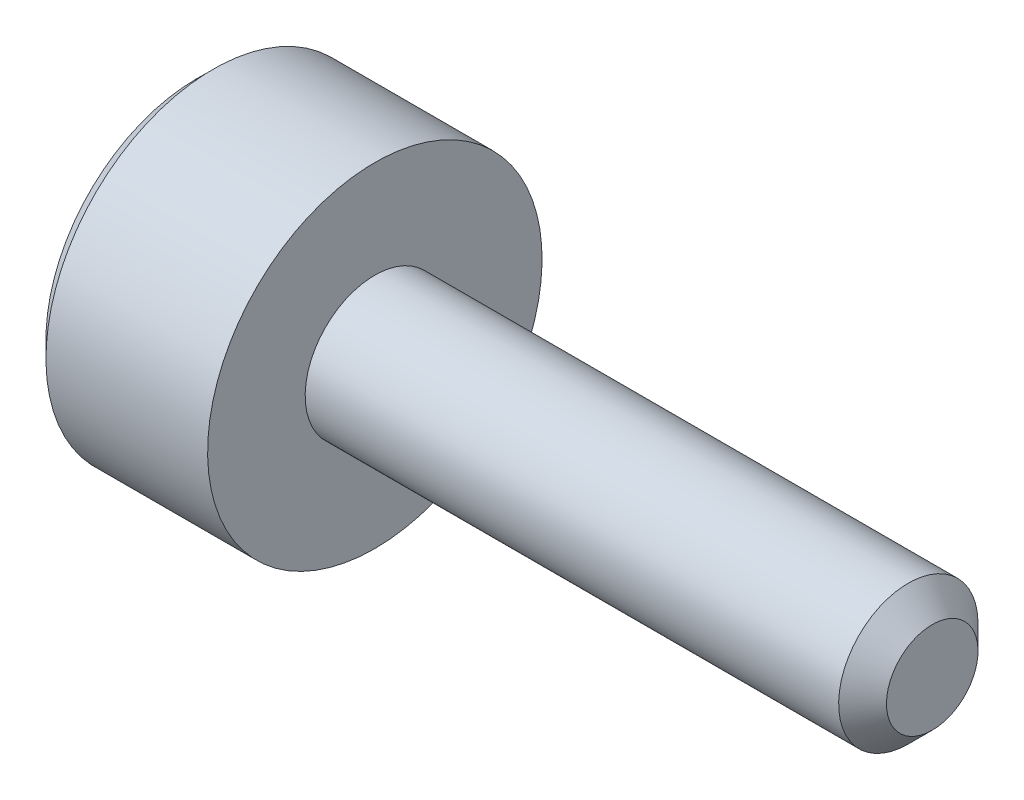
ISO-10303-21;
HEADER;
FILE_DESCRIPTION(('STEP AP214'),'2;1');
FILE_NAME('part.step','',(''),(''),'','','');
FILE_SCHEMA(('AUTOMOTIVE_DESIGN { 1 0 10303 214 1 1 1 1 }'));
ENDSEC;
DATA;
#1=APPLICATION_CONTEXT('core data for automotive mechanical design processes');
#2=APPLICATION_PROTOCOL_DEFINITION('international standard','automotive_design',2000,#1);
#3=PRODUCT_CONTEXT('',#1,'mechanical');
#4=PRODUCT('Part','Part','',(#3));
#5=PRODUCT_RELATED_PRODUCT_CATEGORY('part','',(#4));
#6=PRODUCT_DEFINITION_FORMATION('','',#4);
#7=PRODUCT_DEFINITION_CONTEXT('part definition',#1,'design');
#8=PRODUCT_DEFINITION('design','',#6,#7);
#9=PRODUCT_DEFINITION_SHAPE('','',#8);
#10=(LENGTH_UNIT() NAMED_UNIT(*) SI_UNIT(.MILLI.,.METRE.));
#11=(NAMED_UNIT(*) PLANE_ANGLE_UNIT() SI_UNIT($,.RADIAN.));
#12=(NAMED_UNIT(*) SI_UNIT($,.STERADIAN.) SOLID_ANGLE_UNIT());
#13=UNCERTAINTY_MEASURE_WITH_UNIT(LENGTH_MEASURE(1.E-05),#10,'distance_accuracy_value','');
#14=(GEOMETRIC_REPRESENTATION_CONTEXT(3) GLOBAL_UNCERTAINTY_ASSIGNED_CONTEXT((#13)) GLOBAL_UNIT_ASSIGNED_CONTEXT((#10,
#11,#12)) REPRESENTATION_CONTEXT('',''));
#15=CARTESIAN_POINT('',(0.,0.,0.));
#16=DIRECTION('',(0.,0.,1.));
#17=DIRECTION('',(1.,0.,0.));
#18=AXIS2_PLACEMENT_3D('',#15,#16,#17);
#19=CARTESIAN_POINT('',(-1.6,0.,0.));
#20=DIRECTION('',(1.,0.,0.));
#21=DIRECTION('',(0.,1.,0.));
#22=AXIS2_PLACEMENT_3D('',#19,#20,#21);
#23=PLANE('',#22);
#24=CARTESIAN_POINT('',(-1.6,0.,0.));
#25=DIRECTION('',(-1.,0.,0.));
#26=DIRECTION('',(0.,-1.,0.));
#27=AXIS2_PLACEMENT_3D('',#24,#25,#26);
#28=CIRCLE('',#27,1.35);
#29=CARTESIAN_POINT('',(-1.6,-1.35,0.));
#30=VERTEX_POINT('',#29);
#31=EDGE_CURVE('E11',#30,#30,#28,.T.);
#32=ORIENTED_EDGE('',*,*,#31,.T.);
#33=EDGE_LOOP('',(#32));
#34=FACE_BOUND('',#33,.T.);
#35=DIRECTION('',(0.,-1.,0.));
#36=VECTOR('',#35,1.);
#37=CARTESIAN_POINT('',(-1.6,0.43301270189222,0.75));
#38=LINE('',#37,#36);
#39=CARTESIAN_POINT('',(-1.6,0.43301270189222,0.75));
#40=VERTEX_POINT('',#39);
#41=CARTESIAN_POINT('',(-1.6,-0.43301270189222,0.75));
#42=VERTEX_POINT('',#41);
#43=EDGE_CURVE('E51',#40,#42,#38,.T.);
#44=ORIENTED_EDGE('',*,*,#43,.T.);
#45=DIRECTION('',(0.,-0.500000000000001,-0.866025403784438));
#46=VECTOR('',#45,1.);
#47=CARTESIAN_POINT('',(-1.6,-0.43301270189222,0.75));
#48=LINE('',#47,#46);
#49=CARTESIAN_POINT('',(-1.6,-0.86602540378444,0.));
#50=VERTEX_POINT('',#49);
#51=EDGE_CURVE('E122',#42,#50,#48,.T.);
#52=ORIENTED_EDGE('',*,*,#51,.T.);
#53=DIRECTION('',(0.,0.500000000000001,-0.866025403784438));
#54=VECTOR('',#53,1.);
#55=CARTESIAN_POINT('',(-1.6,-0.86602540378444,0.));
#56=LINE('',#55,#54);
#57=CARTESIAN_POINT('',(-1.6,-0.43301270189222,-0.75));
#58=VERTEX_POINT('',#57);
#59=EDGE_CURVE('E125',#50,#58,#56,.T.);
#60=ORIENTED_EDGE('',*,*,#59,.T.);
#61=DIRECTION('',(0.,1.,0.));
#62=VECTOR('',#61,1.);
#63=CARTESIAN_POINT('',(-1.6,-0.43301270189222,-0.75));
#64=LINE('',#63,#62);
#65=CARTESIAN_POINT('',(-1.6,0.43301270189222,-0.75));
#66=VERTEX_POINT('',#65);
#67=EDGE_CURVE('E128',#58,#66,#64,.T.);
#68=ORIENTED_EDGE('',*,*,#67,.T.);
#69=DIRECTION('',(0.,0.500000000000001,0.866025403784438));
#70=VECTOR('',#69,1.);
#71=CARTESIAN_POINT('',(-1.6,0.43301270189222,-0.75));
#72=LINE('',#71,#70);
#73=CARTESIAN_POINT('',(-1.6,0.86602540378444,0.));
#74=VERTEX_POINT('',#73);
#75=EDGE_CURVE('E112',#66,#74,#72,.T.);
#76=ORIENTED_EDGE('',*,*,#75,.T.);
#77=DIRECTION('',(0.,-0.500000000000001,0.866025403784438));
#78=VECTOR('',#77,1.);
#79=CARTESIAN_POINT('',(-1.6,0.86602540378444,0.));
#80=LINE('',#79,#78);
#81=EDGE_CURVE('E131',#74,#40,#80,.T.);
#82=ORIENTED_EDGE('',*,*,#81,.T.);
#83=EDGE_LOOP('',(#44,#52,#60,#68,#76,#82));
#84=FACE_BOUND('',#83,.T.);
#85=ADVANCED_FACE('F37',(#34,#84),#23,.F.);
#86=CARTESIAN_POINT('',(-1.45,0.,0.));
#87=DIRECTION('',(1.,0.,0.));
#88=DIRECTION('',(0.,1.,0.));
#89=AXIS2_PLACEMENT_3D('',#86,#87,#88);
#90=CONICAL_SURFACE('',#89,1.5,0.785398163397448);
#91=ORIENTED_EDGE('',*,*,#31,.F.);
#92=EDGE_LOOP('',(#91));
#93=FACE_BOUND('',#92,.T.);
#94=CARTESIAN_POINT('',(-1.45,0.,0.));
#95=DIRECTION('',(-1.,0.,0.));
#96=DIRECTION('',(0.,-1.,0.));
#97=AXIS2_PLACEMENT_3D('',#94,#95,#96);
#98=CIRCLE('',#97,1.5);
#99=CARTESIAN_POINT('',(-1.45,-1.5,0.));
#100=VERTEX_POINT('',#99);
#101=EDGE_CURVE('E44',#100,#100,#98,.T.);
#102=ORIENTED_EDGE('',*,*,#101,.T.);
#103=EDGE_LOOP('',(#102));
#104=FACE_BOUND('',#103,.T.);
#105=ADVANCED_FACE('F156',(#93,#104),#90,.T.);
#106=CARTESIAN_POINT('',(5.,0.,0.));
#107=DIRECTION('',(-1.,0.,0.));
#108=DIRECTION('',(0.,-1.,0.));
#109=AXIS2_PLACEMENT_3D('',#106,#107,#108);
#110=CYLINDRICAL_SURFACE('',#109,1.5);
#111=ORIENTED_EDGE('',*,*,#101,.F.);
#112=EDGE_LOOP('',(#111));
#113=FACE_BOUND('',#112,.T.);
#114=CARTESIAN_POINT('',(0.,0.,0.));
#115=DIRECTION('',(-1.,0.,0.));
#116=DIRECTION('',(0.,-1.,0.));
#117=AXIS2_PLACEMENT_3D('',#114,#115,#116);
#118=CIRCLE('',#117,1.5);
#119=CARTESIAN_POINT('',(0.,-1.5,0.));
#120=VERTEX_POINT('',#119);
#121=EDGE_CURVE('E151',#120,#120,#118,.T.);
#122=ORIENTED_EDGE('',*,*,#121,.T.);
#123=EDGE_LOOP('',(#122));
#124=FACE_BOUND('',#123,.T.);
#125=ADVANCED_FACE('F158',(#113,#124),#110,.T.);
#126=CARTESIAN_POINT('',(0.,1.5,0.));
#127=DIRECTION('',(-1.,0.,0.));
#128=DIRECTION('',(0.,-1.,0.));
#129=AXIS2_PLACEMENT_3D('',#126,#127,#128);
#130=PLANE('',#129);
#131=ORIENTED_EDGE('',*,*,#121,.F.);
#132=EDGE_LOOP('',(#131));
#133=FACE_BOUND('',#132,.T.);
#134=CARTESIAN_POINT('',(0.,0.,0.));
#135=DIRECTION('',(-1.,0.,0.));
#136=DIRECTION('',(0.,-1.,0.));
#137=AXIS2_PLACEMENT_3D('',#134,#135,#136);
#138=CIRCLE('',#137,0.625);
#139=CARTESIAN_POINT('',(0.,-0.625,0.));
#140=VERTEX_POINT('',#139);
#141=EDGE_CURVE('E148',#140,#140,#138,.T.);
#142=ORIENTED_EDGE('',*,*,#141,.T.);
#143=EDGE_LOOP('',(#142));
#144=FACE_BOUND('',#143,.T.);
#145=ADVANCED_FACE('F161',(#133,#144),#130,.F.);
#146=CARTESIAN_POINT('',(5.,0.,0.));
#147=DIRECTION('',(-1.,0.,0.));
#148=DIRECTION('',(0.,-1.,0.));
#149=AXIS2_PLACEMENT_3D('',#146,#147,#148);
#150=CYLINDRICAL_SURFACE('',#149,0.625);
#151=ORIENTED_EDGE('',*,*,#141,.F.);
#152=EDGE_LOOP('',(#151));
#153=FACE_BOUND('',#152,.T.);
#154=CARTESIAN_POINT('',(4.7855,0.,0.));
#155=DIRECTION('',(-1.,0.,0.));
#156=DIRECTION('',(0.,-1.,0.));
#157=AXIS2_PLACEMENT_3D('',#154,#155,#156);
#158=CIRCLE('',#157,0.625);
#159=CARTESIAN_POINT('',(4.7855,-0.624999999999999,0.));
#160=VERTEX_POINT('',#159);
#161=EDGE_CURVE('E145',#160,#160,#158,.T.);
#162=ORIENTED_EDGE('',*,*,#161,.T.);
#163=EDGE_LOOP('',(#162));
#164=FACE_BOUND('',#163,.T.);
#165=ADVANCED_FACE('F167',(#153,#164),#150,.T.);
#166=CARTESIAN_POINT('',(5.,0.,0.));
#167=DIRECTION('',(-1.,0.,0.));
#168=DIRECTION('',(0.,-1.,0.));
#169=AXIS2_PLACEMENT_3D('',#166,#167,#168);
#170=CONICAL_SURFACE('',#169,0.4105,0.785398163397447);
#171=ORIENTED_EDGE('',*,*,#161,.F.);
#172=EDGE_LOOP('',(#171));
#173=FACE_BOUND('',#172,.T.);
#174=CARTESIAN_POINT('',(5.,0.,0.));
#175=DIRECTION('',(-1.,0.,0.));
#176=DIRECTION('',(0.,-1.,0.));
#177=AXIS2_PLACEMENT_3D('',#174,#175,#176);
#178=CIRCLE('',#177,0.4105);
#179=CARTESIAN_POINT('',(5.,-0.410499999999999,0.));
#180=VERTEX_POINT('',#179);
#181=EDGE_CURVE('E142',#180,#180,#178,.T.);
#182=ORIENTED_EDGE('',*,*,#181,.T.);
#183=EDGE_LOOP('',(#182));
#184=FACE_BOUND('',#183,.T.);
#185=ADVANCED_FACE('F173',(#173,#184),#170,.T.);
#186=CARTESIAN_POINT('',(5.,0.410500000000001,0.));
#187=DIRECTION('',(-1.,0.,0.));
#188=DIRECTION('',(0.,-1.,0.));
#189=AXIS2_PLACEMENT_3D('',#186,#187,#188);
#190=PLANE('',#189);
#191=ORIENTED_EDGE('',*,*,#181,.F.);
#192=EDGE_LOOP('',(#191));
#193=FACE_BOUND('',#192,.T.);
#194=ADVANCED_FACE('F179',(#193),#190,.F.);
#195=CARTESIAN_POINT('',(-0.96,0.43301270189222,0.75));
#196=DIRECTION('',(0.,0.,-1.));
#197=DIRECTION('',(-1.,0.,0.));
#198=AXIS2_PLACEMENT_3D('',#195,#196,#197);
#199=PLANE('',#198);
#200=ORIENTED_EDGE('',*,*,#43,.F.);
#201=DIRECTION('',(-1.,0.,0.));
#202=VECTOR('',#201,1.);
#203=CARTESIAN_POINT('',(-0.96,0.43301270189222,0.75));
#204=LINE('',#203,#202);
#205=CARTESIAN_POINT('',(-0.96,0.43301270189222,0.75));
#206=VERTEX_POINT('',#205);
#207=EDGE_CURVE('E117',#206,#40,#204,.T.);
#208=ORIENTED_EDGE('',*,*,#207,.F.);
#209=DIRECTION('',(0.,-1.,0.));
#210=VECTOR('',#209,1.);
#211=CARTESIAN_POINT('',(-0.96,0.43301270189222,0.75));
#212=LINE('',#211,#210);
#213=CARTESIAN_POINT('',(-0.96,-0.43301270189222,0.75));
#214=VERTEX_POINT('',#213);
#215=EDGE_CURVE('E134',#206,#214,#212,.T.);
#216=ORIENTED_EDGE('',*,*,#215,.T.);
#217=DIRECTION('',(-1.,0.,0.));
#218=VECTOR('',#217,1.);
#219=CARTESIAN_POINT('',(-0.96,-0.43301270189222,0.75));
#220=LINE('',#219,#218);
#221=EDGE_CURVE('E140',#214,#42,#220,.T.);
#222=ORIENTED_EDGE('',*,*,#221,.T.);
#223=EDGE_LOOP('',(#200,#208,#216,#222));
#224=FACE_BOUND('',#223,.T.);
#225=ADVANCED_FACE('F184',(#224),#199,.T.);
#226=CARTESIAN_POINT('',(-0.96,-0.43301270189222,0.75));
#227=DIRECTION('',(0.,0.866025403784438,-0.500000000000001));
#228=DIRECTION('',(0.,0.500000000000001,0.866025403784438));
#229=AXIS2_PLACEMENT_3D('',#226,#227,#228);
#230=PLANE('',#229);
#231=ORIENTED_EDGE('',*,*,#51,.F.);
#232=ORIENTED_EDGE('',*,*,#221,.F.);
#233=DIRECTION('',(0.,-0.500000000000001,-0.866025403784438));
#234=VECTOR('',#233,1.);
#235=CARTESIAN_POINT('',(-0.96,-0.43301270189222,0.75));
#236=LINE('',#235,#234);
#237=CARTESIAN_POINT('',(-0.96,-0.86602540378444,0.));
#238=VERTEX_POINT('',#237);
#239=EDGE_CURVE('E90',#214,#238,#236,.T.);
#240=ORIENTED_EDGE('',*,*,#239,.T.);
#241=DIRECTION('',(-1.,0.,0.));
#242=VECTOR('',#241,1.);
#243=CARTESIAN_POINT('',(-0.96,-0.86602540378444,0.));
#244=LINE('',#243,#242);
#245=EDGE_CURVE('E138',#238,#50,#244,.T.);
#246=ORIENTED_EDGE('',*,*,#245,.T.);
#247=EDGE_LOOP('',(#231,#232,#240,#246));
#248=FACE_BOUND('',#247,.T.);
#249=ADVANCED_FACE('F189',(#248),#230,.T.);
#250=CARTESIAN_POINT('',(-0.96,-0.86602540378444,0.));
#251=DIRECTION('',(0.,0.866025403784438,0.500000000000001));
#252=DIRECTION('',(0.,-0.500000000000001,0.866025403784438));
#253=AXIS2_PLACEMENT_3D('',#250,#251,#252);
#254=PLANE('',#253);
#255=ORIENTED_EDGE('',*,*,#59,.F.);
#256=ORIENTED_EDGE('',*,*,#245,.F.);
#257=DIRECTION('',(0.,0.500000000000001,-0.866025403784438));
#258=VECTOR('',#257,1.);
#259=CARTESIAN_POINT('',(-0.96,-0.86602540378444,0.));
#260=LINE('',#259,#258);
#261=CARTESIAN_POINT('',(-0.96,-0.43301270189222,-0.75));
#262=VERTEX_POINT('',#261);
#263=EDGE_CURVE('E108',#238,#262,#260,.T.);
#264=ORIENTED_EDGE('',*,*,#263,.T.);
#265=DIRECTION('',(-1.,0.,0.));
#266=VECTOR('',#265,1.);
#267=CARTESIAN_POINT('',(-0.96,-0.43301270189222,-0.75));
#268=LINE('',#267,#266);
#269=EDGE_CURVE('E105',#262,#58,#268,.T.);
#270=ORIENTED_EDGE('',*,*,#269,.T.);
#271=EDGE_LOOP('',(#255,#256,#264,#270));
#272=FACE_BOUND('',#271,.T.);
#273=ADVANCED_FACE('F206',(#272),#254,.T.);
#274=CARTESIAN_POINT('',(-0.96,-0.43301270189222,-0.75));
#275=DIRECTION('',(0.,0.,1.));
#276=DIRECTION('',(1.,0.,0.));
#277=AXIS2_PLACEMENT_3D('',#274,#275,#276);
#278=PLANE('',#277);
#279=ORIENTED_EDGE('',*,*,#67,.F.);
#280=ORIENTED_EDGE('',*,*,#269,.F.);
#281=DIRECTION('',(0.,1.,0.));
#282=VECTOR('',#281,1.);
#283=CARTESIAN_POINT('',(-0.96,-0.43301270189222,-0.75));
#284=LINE('',#283,#282);
#285=CARTESIAN_POINT('',(-0.96,0.43301270189222,-0.75));
#286=VERTEX_POINT('',#285);
#287=EDGE_CURVE('E100',#262,#286,#284,.T.);
#288=ORIENTED_EDGE('',*,*,#287,.T.);
#289=DIRECTION('',(-1.,0.,0.));
#290=VECTOR('',#289,1.);
#291=CARTESIAN_POINT('',(-0.96,0.43301270189222,-0.75));
#292=LINE('',#291,#290);
#293=EDGE_CURVE('E104',#286,#66,#292,.T.);
#294=ORIENTED_EDGE('',*,*,#293,.T.);
#295=EDGE_LOOP('',(#279,#280,#288,#294));
#296=FACE_BOUND('',#295,.T.);
#297=ADVANCED_FACE('F103',(#296),#278,.T.);
#298=CARTESIAN_POINT('',(-0.96,0.43301270189222,-0.75));
#299=DIRECTION('',(0.,-0.866025403784438,0.500000000000001));
#300=DIRECTION('',(0.,-0.500000000000001,-0.866025403784438));
#301=AXIS2_PLACEMENT_3D('',#298,#299,#300);
#302=PLANE('',#301);
#303=ORIENTED_EDGE('',*,*,#75,.F.);
#304=ORIENTED_EDGE('',*,*,#293,.F.);
#305=DIRECTION('',(0.,0.500000000000001,0.866025403784438));
#306=VECTOR('',#305,1.);
#307=CARTESIAN_POINT('',(-0.96,0.43301270189222,-0.75));
#308=LINE('',#307,#306);
#309=CARTESIAN_POINT('',(-0.96,0.86602540378444,0.));
#310=VERTEX_POINT('',#309);
#311=EDGE_CURVE('E107',#286,#310,#308,.T.);
#312=ORIENTED_EDGE('',*,*,#311,.T.);
#313=DIRECTION('',(-1.,0.,0.));
#314=VECTOR('',#313,1.);
#315=CARTESIAN_POINT('',(-0.96,0.86602540378444,0.));
#316=LINE('',#315,#314);
#317=EDGE_CURVE('E81',#310,#74,#316,.T.);
#318=ORIENTED_EDGE('',*,*,#317,.T.);
#319=EDGE_LOOP('',(#303,#304,#312,#318));
#320=FACE_BOUND('',#319,.T.);
#321=ADVANCED_FACE('F110',(#320),#302,.T.);
#322=CARTESIAN_POINT('',(-0.96,0.86602540378444,0.));
#323=DIRECTION('',(0.,-0.866025403784438,-0.500000000000001));
#324=DIRECTION('',(0.,0.500000000000001,-0.866025403784438));
#325=AXIS2_PLACEMENT_3D('',#322,#323,#324);
#326=PLANE('',#325);
#327=ORIENTED_EDGE('',*,*,#81,.F.);
#328=ORIENTED_EDGE('',*,*,#317,.F.);
#329=DIRECTION('',(0.,-0.500000000000001,0.866025403784438));
#330=VECTOR('',#329,1.);
#331=CARTESIAN_POINT('',(-0.96,0.86602540378444,0.));
#332=LINE('',#331,#330);
#333=EDGE_CURVE('E59',#310,#206,#332,.T.);
#334=ORIENTED_EDGE('',*,*,#333,.T.);
#335=ORIENTED_EDGE('',*,*,#207,.T.);
#336=EDGE_LOOP('',(#327,#328,#334,#335));
#337=FACE_BOUND('',#336,.T.);
#338=ADVANCED_FACE('F199',(#337),#326,.T.);
#339=CARTESIAN_POINT('',(-0.96,0.,0.));
#340=DIRECTION('',(1.,0.,0.));
#341=DIRECTION('',(0.,0.,-1.));
#342=AXIS2_PLACEMENT_3D('',#339,#340,#341);
#343=PLANE('',#342);
#344=ORIENTED_EDGE('',*,*,#215,.F.);
#345=ORIENTED_EDGE('',*,*,#333,.F.);
#346=ORIENTED_EDGE('',*,*,#311,.F.);
#347=ORIENTED_EDGE('',*,*,#287,.F.);
#348=ORIENTED_EDGE('',*,*,#263,.F.);
#349=ORIENTED_EDGE('',*,*,#239,.F.);
#350=EDGE_LOOP('',(#344,#345,#346,#347,#348,#349));
#351=FACE_BOUND('',#350,.T.);
#352=ADVANCED_FACE('F115',(#351),#343,.F.);
#353=CLOSED_SHELL('',(#85,#105,#125,#145,#165,#185,#194,#225,#249,#273,#297,#321,#338,#352));
#354=MANIFOLD_SOLID_BREP('B2',#353);
#355=ADVANCED_BREP_SHAPE_REPRESENTATION('',(#18,#354),#14);
#356=SHAPE_DEFINITION_REPRESENTATION(#9,#355);
ENDSEC;
END-ISO-10303-21;
